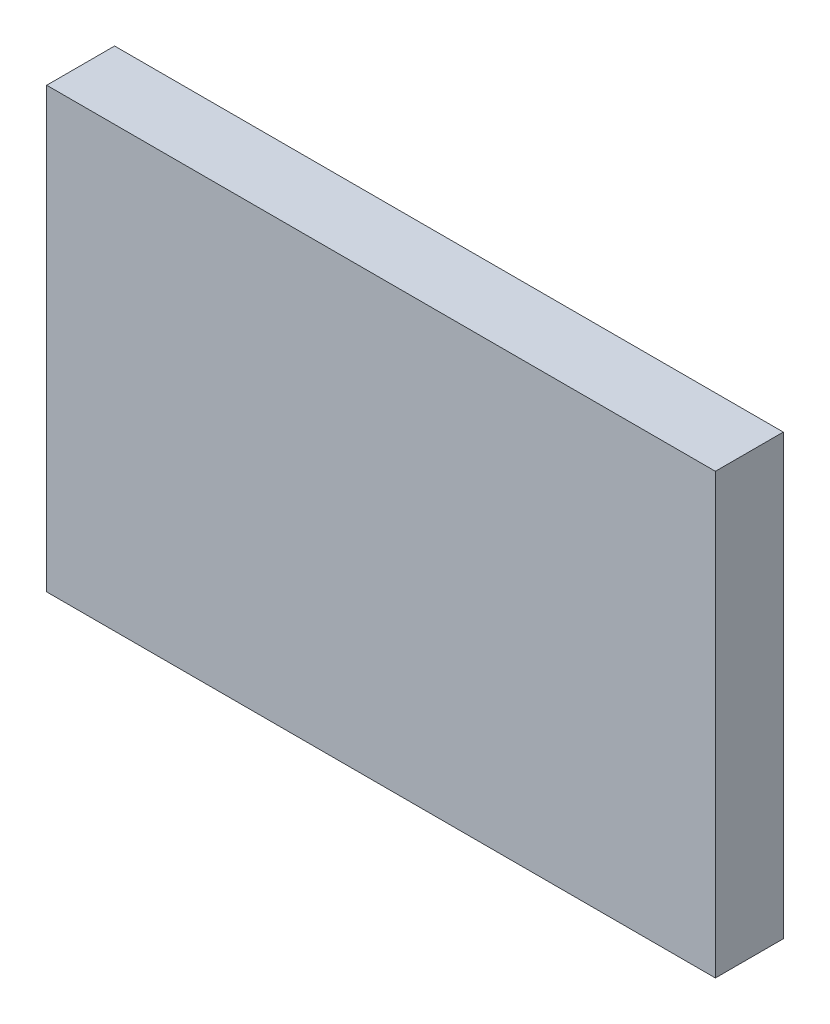
ISO-10303-21;
HEADER;
FILE_DESCRIPTION(('STEP AP214'),'2;1');
FILE_NAME('part.step','',(''),(''),'','','');
FILE_SCHEMA(('AUTOMOTIVE_DESIGN { 1 0 10303 214 1 1 1 1 }'));
ENDSEC;
DATA;
#1=APPLICATION_CONTEXT('core data for automotive mechanical design processes');
#2=APPLICATION_PROTOCOL_DEFINITION('international standard','automotive_design',2000,#1);
#3=PRODUCT_CONTEXT('',#1,'mechanical');
#4=PRODUCT('Part','Part','',(#3));
#5=PRODUCT_RELATED_PRODUCT_CATEGORY('part','',(#4));
#6=PRODUCT_DEFINITION_FORMATION('','',#4);
#7=PRODUCT_DEFINITION_CONTEXT('part definition',#1,'design');
#8=PRODUCT_DEFINITION('design','',#6,#7);
#9=PRODUCT_DEFINITION_SHAPE('','',#8);
#10=(LENGTH_UNIT() NAMED_UNIT(*) SI_UNIT(.MILLI.,.METRE.));
#11=(NAMED_UNIT(*) PLANE_ANGLE_UNIT() SI_UNIT($,.RADIAN.));
#12=(NAMED_UNIT(*) SI_UNIT($,.STERADIAN.) SOLID_ANGLE_UNIT());
#13=UNCERTAINTY_MEASURE_WITH_UNIT(LENGTH_MEASURE(1.E-05),#10,'distance_accuracy_value','');
#14=(GEOMETRIC_REPRESENTATION_CONTEXT(3) GLOBAL_UNCERTAINTY_ASSIGNED_CONTEXT((#13)) GLOBAL_UNIT_ASSIGNED_CONTEXT((#10,
#11,#12)) REPRESENTATION_CONTEXT('',''));
#15=CARTESIAN_POINT('',(0.,0.,0.));
#16=DIRECTION('',(0.,0.,1.));
#17=DIRECTION('',(1.,0.,0.));
#18=AXIS2_PLACEMENT_3D('',#15,#16,#17);
#19=CARTESIAN_POINT('',(0.,0.,6.5));
#20=DIRECTION('',(1.,0.,0.));
#21=DIRECTION('',(0.,0.,-1.));
#22=AXIS2_PLACEMENT_3D('',#19,#20,#21);
#23=PLANE('',#22);
#24=DIRECTION('',(0.,-1.,0.));
#25=VECTOR('',#24,1.);
#26=CARTESIAN_POINT('',(0.,0.,0.));
#27=LINE('',#26,#25);
#28=CARTESIAN_POINT('',(0.,42.,0.));
#29=VERTEX_POINT('',#28);
#30=CARTESIAN_POINT('',(0.,0.,0.));
#31=VERTEX_POINT('',#30);
#32=EDGE_CURVE('E95',#29,#31,#27,.T.);
#33=ORIENTED_EDGE('',*,*,#32,.T.);
#34=DIRECTION('',(0.,0.,-1.));
#35=VECTOR('',#34,1.);
#36=CARTESIAN_POINT('',(0.,0.,6.5));
#37=LINE('',#36,#35);
#38=CARTESIAN_POINT('',(0.,0.,6.5));
#39=VERTEX_POINT('',#38);
#40=EDGE_CURVE('E11',#39,#31,#37,.T.);
#41=ORIENTED_EDGE('',*,*,#40,.F.);
#42=DIRECTION('',(0.,-1.,0.));
#43=VECTOR('',#42,1.);
#44=CARTESIAN_POINT('',(0.,0.,6.5));
#45=LINE('',#44,#43);
#46=CARTESIAN_POINT('',(0.,42.,6.5));
#47=VERTEX_POINT('',#46);
#48=EDGE_CURVE('E83',#47,#39,#45,.T.);
#49=ORIENTED_EDGE('',*,*,#48,.F.);
#50=DIRECTION('',(0.,0.,-1.));
#51=VECTOR('',#50,1.);
#52=CARTESIAN_POINT('',(0.,42.,6.5));
#53=LINE('',#52,#51);
#54=EDGE_CURVE('E91',#47,#29,#53,.T.);
#55=ORIENTED_EDGE('',*,*,#54,.T.);
#56=EDGE_LOOP('',(#33,#41,#49,#55));
#57=FACE_BOUND('',#56,.T.);
#58=ADVANCED_FACE('F32',(#57),#23,.F.);
#59=CARTESIAN_POINT('',(0.,0.,6.5));
#60=DIRECTION('',(0.,1.,0.));
#61=DIRECTION('',(0.,0.,1.));
#62=AXIS2_PLACEMENT_3D('',#59,#60,#61);
#63=PLANE('',#62);
#64=DIRECTION('',(1.,0.,0.));
#65=VECTOR('',#64,1.);
#66=CARTESIAN_POINT('',(0.,0.,0.));
#67=LINE('',#66,#65);
#68=CARTESIAN_POINT('',(64.,0.,0.));
#69=VERTEX_POINT('',#68);
#70=EDGE_CURVE('E87',#31,#69,#67,.T.);
#71=ORIENTED_EDGE('',*,*,#70,.T.);
#72=DIRECTION('',(0.,0.,-1.));
#73=VECTOR('',#72,1.);
#74=CARTESIAN_POINT('',(64.,0.,6.5));
#75=LINE('',#74,#73);
#76=CARTESIAN_POINT('',(64.,0.,6.5));
#77=VERTEX_POINT('',#76);
#78=EDGE_CURVE('E40',#77,#69,#75,.T.);
#79=ORIENTED_EDGE('',*,*,#78,.F.);
#80=DIRECTION('',(1.,0.,0.));
#81=VECTOR('',#80,1.);
#82=CARTESIAN_POINT('',(0.,0.,6.5));
#83=LINE('',#82,#81);
#84=EDGE_CURVE('E78',#39,#77,#83,.T.);
#85=ORIENTED_EDGE('',*,*,#84,.F.);
#86=ORIENTED_EDGE('',*,*,#40,.T.);
#87=EDGE_LOOP('',(#71,#79,#85,#86));
#88=FACE_BOUND('',#87,.T.);
#89=ADVANCED_FACE('F86',(#88),#63,.F.);
#90=CARTESIAN_POINT('',(64.,0.,6.5));
#91=DIRECTION('',(-1.,0.,0.));
#92=DIRECTION('',(0.,0.,1.));
#93=AXIS2_PLACEMENT_3D('',#90,#91,#92);
#94=PLANE('',#93);
#95=DIRECTION('',(0.,1.,0.));
#96=VECTOR('',#95,1.);
#97=CARTESIAN_POINT('',(64.,0.,0.));
#98=LINE('',#97,#96);
#99=CARTESIAN_POINT('',(64.,42.,0.));
#100=VERTEX_POINT('',#99);
#101=EDGE_CURVE('E65',#69,#100,#98,.T.);
#102=ORIENTED_EDGE('',*,*,#101,.T.);
#103=DIRECTION('',(0.,0.,-1.));
#104=VECTOR('',#103,1.);
#105=CARTESIAN_POINT('',(64.,42.,6.5));
#106=LINE('',#105,#104);
#107=CARTESIAN_POINT('',(64.,42.,6.5));
#108=VERTEX_POINT('',#107);
#109=EDGE_CURVE('E88',#108,#100,#106,.T.);
#110=ORIENTED_EDGE('',*,*,#109,.F.);
#111=DIRECTION('',(0.,1.,0.));
#112=VECTOR('',#111,1.);
#113=CARTESIAN_POINT('',(64.,0.,6.5));
#114=LINE('',#113,#112);
#115=EDGE_CURVE('E81',#77,#108,#114,.T.);
#116=ORIENTED_EDGE('',*,*,#115,.F.);
#117=ORIENTED_EDGE('',*,*,#78,.T.);
#118=EDGE_LOOP('',(#102,#110,#116,#117));
#119=FACE_BOUND('',#118,.T.);
#120=ADVANCED_FACE('F89',(#119),#94,.F.);
#121=CARTESIAN_POINT('',(0.,42.,6.5));
#122=DIRECTION('',(0.,-1.,0.));
#123=DIRECTION('',(1.,0.,0.));
#124=AXIS2_PLACEMENT_3D('',#121,#122,#123);
#125=PLANE('',#124);
#126=DIRECTION('',(-1.,0.,0.));
#127=VECTOR('',#126,1.);
#128=CARTESIAN_POINT('',(0.,42.,0.));
#129=LINE('',#128,#127);
#130=EDGE_CURVE('E71',#100,#29,#129,.T.);
#131=ORIENTED_EDGE('',*,*,#130,.T.);
#132=ORIENTED_EDGE('',*,*,#54,.F.);
#133=DIRECTION('',(-1.,0.,0.));
#134=VECTOR('',#133,1.);
#135=CARTESIAN_POINT('',(0.,42.,6.5));
#136=LINE('',#135,#134);
#137=EDGE_CURVE('E48',#108,#47,#136,.T.);
#138=ORIENTED_EDGE('',*,*,#137,.F.);
#139=ORIENTED_EDGE('',*,*,#109,.T.);
#140=EDGE_LOOP('',(#131,#132,#138,#139));
#141=FACE_BOUND('',#140,.T.);
#142=ADVANCED_FACE('F102',(#141),#125,.F.);
#143=CARTESIAN_POINT('',(0.,42.,6.5));
#144=DIRECTION('',(0.,0.,-1.));
#145=DIRECTION('',(-1.,0.,0.));
#146=AXIS2_PLACEMENT_3D('',#143,#144,#145);
#147=PLANE('',#146);
#148=ORIENTED_EDGE('',*,*,#48,.T.);
#149=ORIENTED_EDGE('',*,*,#84,.T.);
#150=ORIENTED_EDGE('',*,*,#115,.T.);
#151=ORIENTED_EDGE('',*,*,#137,.T.);
#152=EDGE_LOOP('',(#148,#149,#150,#151));
#153=FACE_BOUND('',#152,.T.);
#154=ADVANCED_FACE('F79',(#153),#147,.F.);
#155=CARTESIAN_POINT('',(0.,42.,0.));
#156=DIRECTION('',(0.,0.,-1.));
#157=DIRECTION('',(-1.,0.,0.));
#158=AXIS2_PLACEMENT_3D('',#155,#156,#157);
#159=PLANE('',#158);
#160=ORIENTED_EDGE('',*,*,#32,.F.);
#161=ORIENTED_EDGE('',*,*,#130,.F.);
#162=ORIENTED_EDGE('',*,*,#101,.F.);
#163=ORIENTED_EDGE('',*,*,#70,.F.);
#164=EDGE_LOOP('',(#160,#161,#162,#163));
#165=FACE_BOUND('',#164,.T.);
#166=ADVANCED_FACE('F105',(#165),#159,.T.);
#167=CLOSED_SHELL('',(#58,#89,#120,#142,#154,#166));
#168=MANIFOLD_SOLID_BREP('B2',#167);
#169=ADVANCED_BREP_SHAPE_REPRESENTATION('',(#18,#168),#14);
#170=SHAPE_DEFINITION_REPRESENTATION(#9,#169);
ENDSEC;
END-ISO-10303-21;
